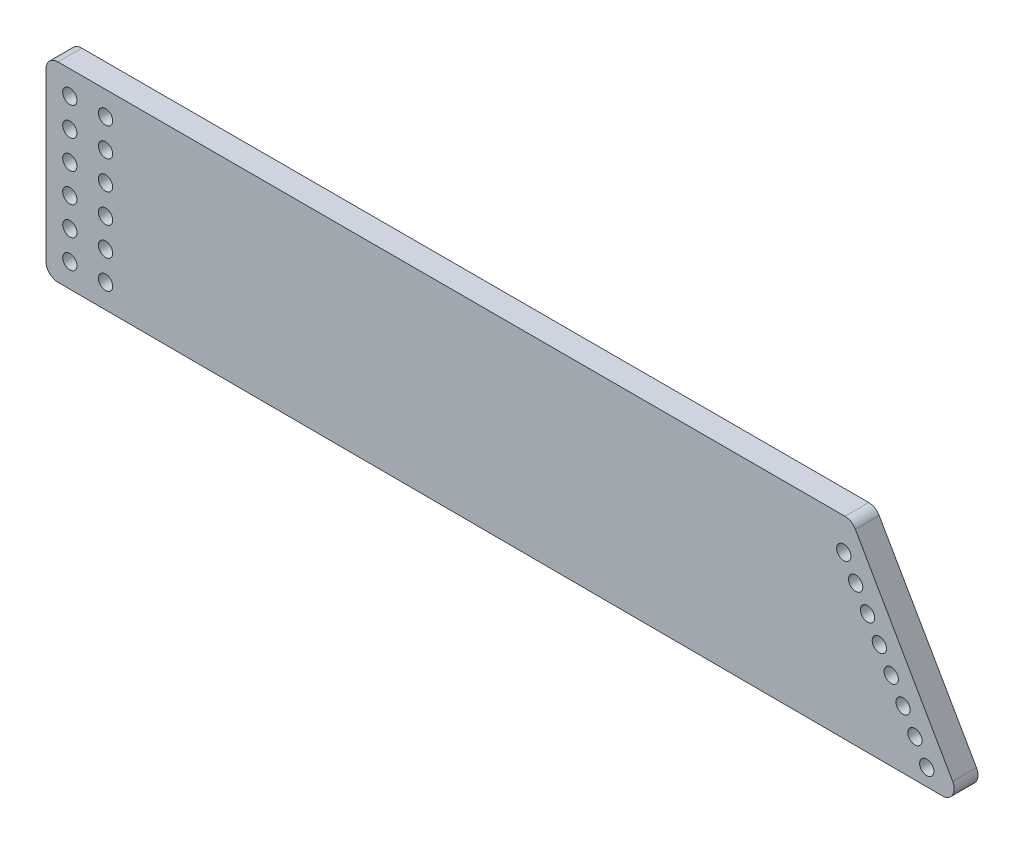
ISO-10303-21;
HEADER;
FILE_DESCRIPTION(('STEP AP214'),'2;1');
FILE_NAME('part.step','',(''),(''),'','','');
FILE_SCHEMA(('AUTOMOTIVE_DESIGN { 1 0 10303 214 1 1 1 1 }'));
ENDSEC;
DATA;
#1=APPLICATION_CONTEXT('core data for automotive mechanical design processes');
#2=APPLICATION_PROTOCOL_DEFINITION('international standard','automotive_design',2000,#1);
#3=PRODUCT_CONTEXT('',#1,'mechanical');
#4=PRODUCT('Part','Part','',(#3));
#5=PRODUCT_RELATED_PRODUCT_CATEGORY('part','',(#4));
#6=PRODUCT_DEFINITION_FORMATION('','',#4);
#7=PRODUCT_DEFINITION_CONTEXT('part definition',#1,'design');
#8=PRODUCT_DEFINITION('design','',#6,#7);
#9=PRODUCT_DEFINITION_SHAPE('','',#8);
#10=(LENGTH_UNIT() NAMED_UNIT(*) SI_UNIT(.MILLI.,.METRE.));
#11=(NAMED_UNIT(*) PLANE_ANGLE_UNIT() SI_UNIT($,.RADIAN.));
#12=(NAMED_UNIT(*) SI_UNIT($,.STERADIAN.) SOLID_ANGLE_UNIT());
#13=UNCERTAINTY_MEASURE_WITH_UNIT(LENGTH_MEASURE(1.E-05),#10,'distance_accuracy_value','');
#14=(GEOMETRIC_REPRESENTATION_CONTEXT(3) GLOBAL_UNCERTAINTY_ASSIGNED_CONTEXT((#13)) GLOBAL_UNIT_ASSIGNED_CONTEXT((#10,
#11,#12)) REPRESENTATION_CONTEXT('',''));
#15=CARTESIAN_POINT('',(0.,0.,0.));
#16=DIRECTION('',(0.,0.,1.));
#17=DIRECTION('',(1.,0.,0.));
#18=AXIS2_PLACEMENT_3D('',#15,#16,#17);
#19=CARTESIAN_POINT('',(-169.15,-40.0547591592116,10.));
#20=DIRECTION('',(1.,0.,0.));
#21=DIRECTION('',(0.,0.,-1.));
#22=AXIS2_PLACEMENT_3D('',#19,#20,#21);
#23=PLANE('',#22);
#24=DIRECTION('',(0.,-1.,0.));
#25=VECTOR('',#24,1.);
#26=CARTESIAN_POINT('',(-169.15,-40.0547591592116,0.));
#27=LINE('',#26,#25);
#28=CARTESIAN_POINT('',(-169.15,35.0547591592116,0.));
#29=VERTEX_POINT('',#28);
#30=CARTESIAN_POINT('',(-169.15,-35.0696361931255,0.));
#31=VERTEX_POINT('',#30);
#32=EDGE_CURVE('E129',#29,#31,#27,.T.);
#33=ORIENTED_EDGE('',*,*,#32,.T.);
#34=DIRECTION('',(0.,0.,-1.));
#35=VECTOR('',#34,1.);
#36=CARTESIAN_POINT('',(-169.15,-35.0696361931255,10.));
#37=LINE('',#36,#35);
#38=CARTESIAN_POINT('',(-169.15,-35.0696361931255,10.));
#39=VERTEX_POINT('',#38);
#40=EDGE_CURVE('E11',#31,#39,#37,.F.);
#41=ORIENTED_EDGE('',*,*,#40,.T.);
#42=DIRECTION('',(0.,-1.,0.));
#43=VECTOR('',#42,1.);
#44=CARTESIAN_POINT('',(-169.15,-40.0547591592116,10.));
#45=LINE('',#44,#43);
#46=CARTESIAN_POINT('',(-169.15,35.0547591592116,10.));
#47=VERTEX_POINT('',#46);
#48=EDGE_CURVE('E127',#47,#39,#45,.T.);
#49=ORIENTED_EDGE('',*,*,#48,.F.);
#50=DIRECTION('',(0.,0.,-1.));
#51=VECTOR('',#50,1.);
#52=CARTESIAN_POINT('',(-169.15,35.0547591592116,10.));
#53=LINE('',#52,#51);
#54=EDGE_CURVE('E41',#47,#29,#53,.T.);
#55=ORIENTED_EDGE('',*,*,#54,.T.);
#56=EDGE_LOOP('',(#33,#41,#49,#55));
#57=FACE_BOUND('',#56,.T.);
#58=ADVANCED_FACE('F33',(#57),#23,.F.);
#59=CARTESIAN_POINT('',(215.741136719662,-41.2016756718341,10.));
#60=DIRECTION('',(0.00297983328589271,0.999995560286939,0.));
#61=DIRECTION('',(-0.999995560286939,0.00297983328589271,0.));
#62=AXIS2_PLACEMENT_3D('',#59,#60,#61);
#63=PLANE('',#62);
#64=DIRECTION('',(0.999995560286938,-0.00297983328589271,0.));
#65=VECTOR('',#64,1.);
#66=CARTESIAN_POINT('',(215.741136719662,-41.2016756718341,0.));
#67=LINE('',#66,#65);
#68=CARTESIAN_POINT('',(-164.164899166429,-40.0696139945602,0.));
#69=VERTEX_POINT('',#68);
#70=CARTESIAN_POINT('',(207.080921130861,-41.1758695585879,0.));
#71=VERTEX_POINT('',#70);
#72=EDGE_CURVE('E125',#69,#71,#67,.T.);
#73=ORIENTED_EDGE('',*,*,#72,.T.);
#74=DIRECTION('',(0.,0.,-1.));
#75=VECTOR('',#74,1.);
#76=CARTESIAN_POINT('',(207.080921130861,-41.1758695585879,10.));
#77=LINE('',#76,#75);
#78=CARTESIAN_POINT('',(207.080921130861,-41.1758695585879,10.));
#79=VERTEX_POINT('',#78);
#80=EDGE_CURVE('E104',#71,#79,#77,.F.);
#81=ORIENTED_EDGE('',*,*,#80,.T.);
#82=DIRECTION('',(0.999995560286938,-0.00297983328589271,0.));
#83=VECTOR('',#82,1.);
#84=CARTESIAN_POINT('',(215.741136719662,-41.2016756718341,10.));
#85=LINE('',#84,#83);
#86=CARTESIAN_POINT('',(-164.164899166429,-40.0696139945602,10.));
#87=VERTEX_POINT('',#86);
#88=EDGE_CURVE('E169',#87,#79,#85,.T.);
#89=ORIENTED_EDGE('',*,*,#88,.F.);
#90=DIRECTION('',(0.,0.,-1.));
#91=VECTOR('',#90,1.);
#92=CARTESIAN_POINT('',(-164.164899166429,-40.0696139945602,10.));
#93=LINE('',#92,#91);
#94=EDGE_CURVE('E109',#87,#69,#93,.T.);
#95=ORIENTED_EDGE('',*,*,#94,.T.);
#96=EDGE_LOOP('',(#73,#81,#89,#95));
#97=FACE_BOUND('',#96,.T.);
#98=ADVANCED_FACE('F319',(#97),#63,.F.);
#99=CARTESIAN_POINT('',(169.15,40.0547591592116,10.));
#100=DIRECTION('',(-0.867511475523086,-0.497417168818848,0.));
#101=DIRECTION('',(0.497417168818848,-0.867511475523086,0.));
#102=AXIS2_PLACEMENT_3D('',#99,#100,#101);
#103=PLANE('',#102);
#104=DIRECTION('',(-0.497417168818848,0.867511475523086,0.));
#105=VECTOR('',#104,1.);
#106=CARTESIAN_POINT('',(169.15,40.0547591592116,10.));
#107=LINE('',#106,#105);
#108=CARTESIAN_POINT('',(211.433377674906,-33.6888059130589,10.));
#109=VERTEX_POINT('',#108);
#110=CARTESIAN_POINT('',(170.590864680391,37.5418450033058,10.));
#111=VERTEX_POINT('',#110);
#112=EDGE_CURVE('E118',#109,#111,#107,.T.);
#113=ORIENTED_EDGE('',*,*,#112,.F.);
#114=DIRECTION('',(0.,0.,-1.));
#115=VECTOR('',#114,1.);
#116=CARTESIAN_POINT('',(211.433377674906,-33.6888059130589,10.));
#117=LINE('',#116,#115);
#118=CARTESIAN_POINT('',(211.433377674906,-33.6888059130589,0.));
#119=VERTEX_POINT('',#118);
#120=EDGE_CURVE('E103',#109,#119,#117,.T.);
#121=ORIENTED_EDGE('',*,*,#120,.T.);
#122=DIRECTION('',(-0.497417168818848,0.867511475523086,0.));
#123=VECTOR('',#122,1.);
#124=CARTESIAN_POINT('',(169.15,40.0547591592116,0.));
#125=LINE('',#124,#123);
#126=CARTESIAN_POINT('',(170.590864680391,37.5418450033058,0.));
#127=VERTEX_POINT('',#126);
#128=EDGE_CURVE('E116',#119,#127,#125,.T.);
#129=ORIENTED_EDGE('',*,*,#128,.T.);
#130=DIRECTION('',(0.,0.,-1.));
#131=VECTOR('',#130,1.);
#132=CARTESIAN_POINT('',(170.590864680391,37.5418450033058,10.));
#133=LINE('',#132,#131);
#134=EDGE_CURVE('E120',#127,#111,#133,.F.);
#135=ORIENTED_EDGE('',*,*,#134,.T.);
#136=EDGE_LOOP('',(#113,#121,#129,#135));
#137=FACE_BOUND('',#136,.T.);
#138=ADVANCED_FACE('F115',(#137),#103,.F.);
#139=CARTESIAN_POINT('',(-169.15,40.0547591592116,10.));
#140=DIRECTION('',(0.,-1.,0.));
#141=DIRECTION('',(1.,0.,0.));
#142=AXIS2_PLACEMENT_3D('',#139,#140,#141);
#143=PLANE('',#142);
#144=DIRECTION('',(-1.,0.,0.));
#145=VECTOR('',#144,1.);
#146=CARTESIAN_POINT('',(-169.15,40.0547591592116,10.));
#147=LINE('',#146,#145);
#148=CARTESIAN_POINT('',(166.253307302776,40.0547591592116,10.));
#149=VERTEX_POINT('',#148);
#150=CARTESIAN_POINT('',(-164.15,40.0547591592116,10.));
#151=VERTEX_POINT('',#150);
#152=EDGE_CURVE('E133',#149,#151,#147,.T.);
#153=ORIENTED_EDGE('',*,*,#152,.F.);
#154=DIRECTION('',(0.,0.,-1.));
#155=VECTOR('',#154,1.);
#156=CARTESIAN_POINT('',(166.253307302776,40.0547591592116,10.));
#157=LINE('',#156,#155);
#158=CARTESIAN_POINT('',(166.253307302776,40.0547591592116,0.));
#159=VERTEX_POINT('',#158);
#160=EDGE_CURVE('E150',#149,#159,#157,.T.);
#161=ORIENTED_EDGE('',*,*,#160,.T.);
#162=DIRECTION('',(-1.,0.,0.));
#163=VECTOR('',#162,1.);
#164=CARTESIAN_POINT('',(-169.15,40.0547591592116,0.));
#165=LINE('',#164,#163);
#166=CARTESIAN_POINT('',(-164.15,40.0547591592116,0.));
#167=VERTEX_POINT('',#166);
#168=EDGE_CURVE('E124',#159,#167,#165,.T.);
#169=ORIENTED_EDGE('',*,*,#168,.T.);
#170=DIRECTION('',(0.,0.,-1.));
#171=VECTOR('',#170,1.);
#172=CARTESIAN_POINT('',(-164.15,40.0547591592116,10.));
#173=LINE('',#172,#171);
#174=EDGE_CURVE('E48',#167,#151,#173,.F.);
#175=ORIENTED_EDGE('',*,*,#174,.T.);
#176=EDGE_LOOP('',(#153,#161,#169,#175));
#177=FACE_BOUND('',#176,.T.);
#178=ADVANCED_FACE('F312',(#177),#143,.F.);
#179=CARTESIAN_POINT('',(0.,0.,10.));
#180=DIRECTION('',(0.,0.,-1.));
#181=DIRECTION('',(-1.,0.,0.));
#182=AXIS2_PLACEMENT_3D('',#179,#180,#181);
#183=PLANE('',#182);
#184=CARTESIAN_POINT('',(180.685584579235,0.645927325171431,10.));
#185=DIRECTION('',(0.,0.,-1.));
#186=DIRECTION('',(-1.,0.,0.));
#187=AXIS2_PLACEMENT_3D('',#184,#185,#186);
#188=CIRCLE('',#187,2.99999999999999);
#189=CARTESIAN_POINT('',(177.685584579235,0.645927325171431,10.));
#190=VERTEX_POINT('',#189);
#191=EDGE_CURVE('E162',#190,#190,#188,.T.);
#192=ORIENTED_EDGE('',*,*,#191,.T.);
#193=EDGE_LOOP('',(#192));
#194=FACE_BOUND('',#193,.T.);
#195=CARTESIAN_POINT('',(185.659756267424,-8.02918743005944,10.));
#196=DIRECTION('',(0.,0.,-1.));
#197=DIRECTION('',(-1.,0.,0.));
#198=AXIS2_PLACEMENT_3D('',#195,#196,#197);
#199=CIRCLE('',#198,2.99999999999999);
#200=CARTESIAN_POINT('',(182.659756267424,-8.02918743005944,10.));
#201=VERTEX_POINT('',#200);
#202=EDGE_CURVE('E164',#201,#201,#199,.T.);
#203=ORIENTED_EDGE('',*,*,#202,.T.);
#204=EDGE_LOOP('',(#203));
#205=FACE_BOUND('',#204,.T.);
#206=CARTESIAN_POINT('',(190.633927955612,-16.7043021852903,10.));
#207=DIRECTION('',(0.,0.,-1.));
#208=DIRECTION('',(-1.,0.,0.));
#209=AXIS2_PLACEMENT_3D('',#206,#207,#208);
#210=CIRCLE('',#209,2.99999999999999);
#211=CARTESIAN_POINT('',(187.633927955612,-16.7043021852903,10.));
#212=VERTEX_POINT('',#211);
#213=EDGE_CURVE('E175',#212,#212,#210,.T.);
#214=ORIENTED_EDGE('',*,*,#213,.T.);
#215=EDGE_LOOP('',(#214));
#216=FACE_BOUND('',#215,.T.);
#217=CARTESIAN_POINT('',(195.608099643801,-25.3794169405212,10.));
#218=DIRECTION('',(0.,0.,-1.));
#219=DIRECTION('',(-1.,0.,0.));
#220=AXIS2_PLACEMENT_3D('',#217,#218,#219);
#221=CIRCLE('',#220,2.99999999999999);
#222=CARTESIAN_POINT('',(192.608099643801,-25.3794169405212,10.));
#223=VERTEX_POINT('',#222);
#224=EDGE_CURVE('E178',#223,#223,#221,.T.);
#225=ORIENTED_EDGE('',*,*,#224,.T.);
#226=EDGE_LOOP('',(#225));
#227=FACE_BOUND('',#226,.T.);
#228=CARTESIAN_POINT('',(165.76306951467,26.671271590864,10.));
#229=DIRECTION('',(0.,0.,-1.));
#230=DIRECTION('',(-1.,0.,0.));
#231=AXIS2_PLACEMENT_3D('',#228,#229,#230);
#232=CIRCLE('',#231,2.99999999999999);
#233=CARTESIAN_POINT('',(162.76306951467,26.671271590864,10.));
#234=VERTEX_POINT('',#233);
#235=EDGE_CURVE('E181',#234,#234,#232,.T.);
#236=ORIENTED_EDGE('',*,*,#235,.T.);
#237=EDGE_LOOP('',(#236));
#238=FACE_BOUND('',#237,.T.);
#239=CARTESIAN_POINT('',(-144.147356074622,-30.0674372837863,10.));
#240=DIRECTION('',(0.,0.,-1.));
#241=DIRECTION('',(-1.,0.,0.));
#242=AXIS2_PLACEMENT_3D('',#239,#240,#241);
#243=CIRCLE('',#242,2.99999999999994);
#244=CARTESIAN_POINT('',(-147.147356074622,-30.0674372837863,10.));
#245=VERTEX_POINT('',#244);
#246=EDGE_CURVE('E184',#245,#245,#243,.T.);
#247=ORIENTED_EDGE('',*,*,#246,.T.);
#248=EDGE_LOOP('',(#247));
#249=FACE_BOUND('',#248,.T.);
#250=CARTESIAN_POINT('',(-159.147356016605,-30.0687565596259,10.));
#251=DIRECTION('',(0.,0.,-1.));
#252=DIRECTION('',(-1.,0.,0.));
#253=AXIS2_PLACEMENT_3D('',#250,#251,#252);
#254=CIRCLE('',#253,2.99999999999999);
#255=CARTESIAN_POINT('',(-162.147356016605,-30.0687565596259,10.));
#256=VERTEX_POINT('',#255);
#257=EDGE_CURVE('E187',#256,#256,#254,.T.);
#258=ORIENTED_EDGE('',*,*,#257,.T.);
#259=EDGE_LOOP('',(#258));
#260=FACE_BOUND('',#259,.T.);
#261=CARTESIAN_POINT('',(-159.148411437277,-18.068756606039,10.));
#262=DIRECTION('',(0.,0.,-1.));
#263=DIRECTION('',(-1.,0.,0.));
#264=AXIS2_PLACEMENT_3D('',#261,#262,#263);
#265=CIRCLE('',#264,2.99999999999999);
#266=CARTESIAN_POINT('',(-162.148411437277,-18.068756606039,10.));
#267=VERTEX_POINT('',#266);
#268=EDGE_CURVE('E190',#267,#267,#265,.T.);
#269=ORIENTED_EDGE('',*,*,#268,.T.);
#270=EDGE_LOOP('',(#269));
#271=FACE_BOUND('',#270,.T.);
#272=CARTESIAN_POINT('',(-144.15,18.0547591592116,10.));
#273=DIRECTION('',(0.,0.,-1.));
#274=DIRECTION('',(-1.,0.,0.));
#275=AXIS2_PLACEMENT_3D('',#272,#273,#274);
#276=CIRCLE('',#275,2.99999999999999);
#277=CARTESIAN_POINT('',(-147.15,18.0547591592116,10.));
#278=VERTEX_POINT('',#277);
#279=EDGE_CURVE('E193',#278,#278,#276,.T.);
#280=ORIENTED_EDGE('',*,*,#279,.T.);
#281=EDGE_LOOP('',(#280));
#282=FACE_BOUND('',#281,.T.);
#283=CARTESIAN_POINT('',(-159.15,6.05475915921157,10.));
#284=DIRECTION('',(0.,0.,-1.));
#285=DIRECTION('',(-1.,0.,0.));
#286=AXIS2_PLACEMENT_3D('',#283,#284,#285);
#287=CIRCLE('',#286,2.99999999999999);
#288=CARTESIAN_POINT('',(-162.15,6.05475915921157,10.));
#289=VERTEX_POINT('',#288);
#290=EDGE_CURVE('E196',#289,#289,#287,.T.);
#291=ORIENTED_EDGE('',*,*,#290,.T.);
#292=EDGE_LOOP('',(#291));
#293=FACE_BOUND('',#292,.T.);
#294=CARTESIAN_POINT('',(-159.15,18.0547591592116,10.));
#295=DIRECTION('',(0.,0.,-1.));
#296=DIRECTION('',(-1.,0.,0.));
#297=AXIS2_PLACEMENT_3D('',#294,#295,#296);
#298=CIRCLE('',#297,2.99999999999999);
#299=CARTESIAN_POINT('',(-162.15,18.0547591592116,10.));
#300=VERTEX_POINT('',#299);
#301=EDGE_CURVE('E199',#300,#300,#298,.T.);
#302=ORIENTED_EDGE('',*,*,#301,.T.);
#303=EDGE_LOOP('',(#302));
#304=FACE_BOUND('',#303,.T.);
#305=CARTESIAN_POINT('',(-159.15,30.0547591592116,10.));
#306=DIRECTION('',(0.,0.,-1.));
#307=DIRECTION('',(-1.,0.,0.));
#308=AXIS2_PLACEMENT_3D('',#305,#306,#307);
#309=CIRCLE('',#308,2.99999999999999);
#310=CARTESIAN_POINT('',(-162.15,30.0547591592116,10.));
#311=VERTEX_POINT('',#310);
#312=EDGE_CURVE('E202',#311,#311,#309,.T.);
#313=ORIENTED_EDGE('',*,*,#312,.T.);
#314=EDGE_LOOP('',(#313));
#315=FACE_BOUND('',#314,.T.);
#316=CARTESIAN_POINT('',(-159.149466857949,-6.06875665245198,10.));
#317=DIRECTION('',(0.,0.,-1.));
#318=DIRECTION('',(-1.,0.,0.));
#319=AXIS2_PLACEMENT_3D('',#316,#317,#318);
#320=CIRCLE('',#319,2.99999999999999);
#321=CARTESIAN_POINT('',(-162.149466857949,-6.06875665245198,10.));
#322=VERTEX_POINT('',#321);
#323=EDGE_CURVE('E205',#322,#322,#320,.T.);
#324=ORIENTED_EDGE('',*,*,#323,.T.);
#325=EDGE_LOOP('',(#324));
#326=FACE_BOUND('',#325,.T.);
#327=CARTESIAN_POINT('',(-144.148411495293,-18.0674373301993,10.));
#328=DIRECTION('',(0.,0.,-1.));
#329=DIRECTION('',(-1.,0.,0.));
#330=AXIS2_PLACEMENT_3D('',#327,#328,#329);
#331=CIRCLE('',#330,2.99999999999994);
#332=CARTESIAN_POINT('',(-147.148411495293,-18.0674373301993,10.));
#333=VERTEX_POINT('',#332);
#334=EDGE_CURVE('E208',#333,#333,#331,.T.);
#335=ORIENTED_EDGE('',*,*,#334,.T.);
#336=EDGE_LOOP('',(#335));
#337=FACE_BOUND('',#336,.T.);
#338=CARTESIAN_POINT('',(-144.149466915965,-6.06743737661232,10.));
#339=DIRECTION('',(0.,0.,-1.));
#340=DIRECTION('',(-1.,0.,0.));
#341=AXIS2_PLACEMENT_3D('',#338,#339,#340);
#342=CIRCLE('',#341,2.99999999999994);
#343=CARTESIAN_POINT('',(-147.149466915965,-6.06743737661232,10.));
#344=VERTEX_POINT('',#343);
#345=EDGE_CURVE('E211',#344,#344,#342,.T.);
#346=ORIENTED_EDGE('',*,*,#345,.T.);
#347=EDGE_LOOP('',(#346));
#348=FACE_BOUND('',#347,.T.);
#349=CARTESIAN_POINT('',(-144.15,6.05475915921157,10.));
#350=DIRECTION('',(0.,0.,-1.));
#351=DIRECTION('',(-1.,0.,0.));
#352=AXIS2_PLACEMENT_3D('',#349,#350,#351);
#353=CIRCLE('',#352,2.99999999999999);
#354=CARTESIAN_POINT('',(-147.15,6.05475915921157,10.));
#355=VERTEX_POINT('',#354);
#356=EDGE_CURVE('E214',#355,#355,#353,.T.);
#357=ORIENTED_EDGE('',*,*,#356,.T.);
#358=EDGE_LOOP('',(#357));
#359=FACE_BOUND('',#358,.T.);
#360=CARTESIAN_POINT('',(175.711412891047,9.32104208040228,10.));
#361=DIRECTION('',(0.,0.,-1.));
#362=DIRECTION('',(-1.,0.,0.));
#363=AXIS2_PLACEMENT_3D('',#360,#361,#362);
#364=CIRCLE('',#363,2.99999999999999);
#365=CARTESIAN_POINT('',(172.711412891047,9.32104208040228,10.));
#366=VERTEX_POINT('',#365);
#367=EDGE_CURVE('E217',#366,#366,#364,.T.);
#368=ORIENTED_EDGE('',*,*,#367,.T.);
#369=EDGE_LOOP('',(#368));
#370=FACE_BOUND('',#369,.T.);
#371=CARTESIAN_POINT('',(170.737241202858,17.9961568356331,10.));
#372=DIRECTION('',(0.,0.,-1.));
#373=DIRECTION('',(-1.,0.,0.));
#374=AXIS2_PLACEMENT_3D('',#371,#372,#373);
#375=CIRCLE('',#374,2.99999999999999);
#376=CARTESIAN_POINT('',(167.737241202858,17.9961568356331,10.));
#377=VERTEX_POINT('',#376);
#378=EDGE_CURVE('E220',#377,#377,#375,.T.);
#379=ORIENTED_EDGE('',*,*,#378,.T.);
#380=EDGE_LOOP('',(#379));
#381=FACE_BOUND('',#380,.T.);
#382=CARTESIAN_POINT('',(200.582271331989,-34.054531695752,10.));
#383=DIRECTION('',(0.,0.,-1.));
#384=DIRECTION('',(-1.,0.,0.));
#385=AXIS2_PLACEMENT_3D('',#382,#383,#384);
#386=CIRCLE('',#385,2.99999999999999);
#387=CARTESIAN_POINT('',(197.582271331989,-34.054531695752,10.));
#388=VERTEX_POINT('',#387);
#389=EDGE_CURVE('E223',#388,#388,#386,.T.);
#390=ORIENTED_EDGE('',*,*,#389,.T.);
#391=EDGE_LOOP('',(#390));
#392=FACE_BOUND('',#391,.T.);
#393=CARTESIAN_POINT('',(-144.15,30.0547591592116,10.));
#394=DIRECTION('',(0.,0.,-1.));
#395=DIRECTION('',(-1.,0.,0.));
#396=AXIS2_PLACEMENT_3D('',#393,#394,#395);
#397=CIRCLE('',#396,2.99999999999999);
#398=CARTESIAN_POINT('',(-147.15,30.0547591592116,10.));
#399=VERTEX_POINT('',#398);
#400=EDGE_CURVE('E226',#399,#399,#397,.T.);
#401=ORIENTED_EDGE('',*,*,#400,.T.);
#402=EDGE_LOOP('',(#401));
#403=FACE_BOUND('',#402,.T.);
#404=ORIENTED_EDGE('',*,*,#88,.T.);
#405=CARTESIAN_POINT('',(207.09582029729,-36.1758917571532,10.));
#406=DIRECTION('',(0.,0.,-1.));
#407=DIRECTION('',(-1.,0.,0.));
#408=AXIS2_PLACEMENT_3D('',#405,#406,#407);
#409=CIRCLE('',#408,5.);
#410=EDGE_CURVE('E147',#79,#109,#409,.F.);
#411=ORIENTED_EDGE('',*,*,#410,.T.);
#412=ORIENTED_EDGE('',*,*,#112,.T.);
#413=CARTESIAN_POINT('',(166.253307302776,35.0547591592116,10.));
#414=DIRECTION('',(0.,0.,-1.));
#415=DIRECTION('',(-1.,0.,0.));
#416=AXIS2_PLACEMENT_3D('',#413,#414,#415);
#417=CIRCLE('',#416,5.);
#418=EDGE_CURVE('E55',#111,#149,#417,.F.);
#419=ORIENTED_EDGE('',*,*,#418,.T.);
#420=ORIENTED_EDGE('',*,*,#152,.T.);
#421=CARTESIAN_POINT('',(-164.15,35.0547591592116,10.));
#422=DIRECTION('',(0.,0.,-1.));
#423=DIRECTION('',(-1.,0.,0.));
#424=AXIS2_PLACEMENT_3D('',#421,#422,#423);
#425=CIRCLE('',#424,5.);
#426=EDGE_CURVE('E142',#151,#47,#425,.F.);
#427=ORIENTED_EDGE('',*,*,#426,.T.);
#428=ORIENTED_EDGE('',*,*,#48,.T.);
#429=CARTESIAN_POINT('',(-164.15,-35.0696361931255,10.));
#430=DIRECTION('',(0.,0.,-1.));
#431=DIRECTION('',(-1.,0.,0.));
#432=AXIS2_PLACEMENT_3D('',#429,#430,#431);
#433=CIRCLE('',#432,5.);
#434=EDGE_CURVE('E144',#39,#87,#433,.F.);
#435=ORIENTED_EDGE('',*,*,#434,.T.);
#436=EDGE_LOOP('',(#404,#411,#412,#419,#420,#427,#428,#435));
#437=FACE_BOUND('',#436,.T.);
#438=ADVANCED_FACE('F295',(#194,#205,#216,#227,#238,#249,#260,#271,#282,#293,#304,#315,#326,
#337,#348,#359,#370,#381,#392,#403,#437),#183,.F.);
#439=CARTESIAN_POINT('',(0.,0.,0.));
#440=DIRECTION('',(0.,0.,-1.));
#441=DIRECTION('',(-1.,0.,0.));
#442=AXIS2_PLACEMENT_3D('',#439,#440,#441);
#443=PLANE('',#442);
#444=CARTESIAN_POINT('',(180.685584579235,0.645927325171431,0.));
#445=DIRECTION('',(0.,0.,-1.));
#446=DIRECTION('',(-1.,0.,0.));
#447=AXIS2_PLACEMENT_3D('',#444,#445,#446);
#448=CIRCLE('',#447,2.99999999999999);
#449=CARTESIAN_POINT('',(177.685584579235,0.645927325171431,0.));
#450=VERTEX_POINT('',#449);
#451=EDGE_CURVE('E257',#450,#450,#448,.T.);
#452=ORIENTED_EDGE('',*,*,#451,.F.);
#453=EDGE_LOOP('',(#452));
#454=FACE_BOUND('',#453,.T.);
#455=CARTESIAN_POINT('',(185.659756267424,-8.02918743005944,0.));
#456=DIRECTION('',(0.,0.,-1.));
#457=DIRECTION('',(-1.,0.,0.));
#458=AXIS2_PLACEMENT_3D('',#455,#456,#457);
#459=CIRCLE('',#458,2.99999999999999);
#460=CARTESIAN_POINT('',(182.659756267424,-8.02918743005944,0.));
#461=VERTEX_POINT('',#460);
#462=EDGE_CURVE('E260',#461,#461,#459,.T.);
#463=ORIENTED_EDGE('',*,*,#462,.F.);
#464=EDGE_LOOP('',(#463));
#465=FACE_BOUND('',#464,.T.);
#466=CARTESIAN_POINT('',(190.633927955612,-16.7043021852903,0.));
#467=DIRECTION('',(0.,0.,-1.));
#468=DIRECTION('',(-1.,0.,0.));
#469=AXIS2_PLACEMENT_3D('',#466,#467,#468);
#470=CIRCLE('',#469,2.99999999999999);
#471=CARTESIAN_POINT('',(187.633927955612,-16.7043021852903,0.));
#472=VERTEX_POINT('',#471);
#473=EDGE_CURVE('E264',#472,#472,#470,.T.);
#474=ORIENTED_EDGE('',*,*,#473,.F.);
#475=EDGE_LOOP('',(#474));
#476=FACE_BOUND('',#475,.T.);
#477=CARTESIAN_POINT('',(195.608099643801,-25.3794169405212,0.));
#478=DIRECTION('',(0.,0.,-1.));
#479=DIRECTION('',(-1.,0.,0.));
#480=AXIS2_PLACEMENT_3D('',#477,#478,#479);
#481=CIRCLE('',#480,2.99999999999999);
#482=CARTESIAN_POINT('',(192.608099643801,-25.3794169405212,0.));
#483=VERTEX_POINT('',#482);
#484=EDGE_CURVE('E267',#483,#483,#481,.T.);
#485=ORIENTED_EDGE('',*,*,#484,.F.);
#486=EDGE_LOOP('',(#485));
#487=FACE_BOUND('',#486,.T.);
#488=CARTESIAN_POINT('',(165.76306951467,26.671271590864,0.));
#489=DIRECTION('',(0.,0.,-1.));
#490=DIRECTION('',(-1.,0.,0.));
#491=AXIS2_PLACEMENT_3D('',#488,#489,#490);
#492=CIRCLE('',#491,2.99999999999999);
#493=CARTESIAN_POINT('',(162.76306951467,26.671271590864,0.));
#494=VERTEX_POINT('',#493);
#495=EDGE_CURVE('E270',#494,#494,#492,.T.);
#496=ORIENTED_EDGE('',*,*,#495,.F.);
#497=EDGE_LOOP('',(#496));
#498=FACE_BOUND('',#497,.T.);
#499=CARTESIAN_POINT('',(-144.147356074622,-30.0674372837863,0.));
#500=DIRECTION('',(0.,0.,-1.));
#501=DIRECTION('',(1.,0.,0.));
#502=AXIS2_PLACEMENT_3D('',#499,#500,#501);
#503=CIRCLE('',#502,2.99999999999994);
#504=CARTESIAN_POINT('',(-141.147356074622,-30.0674372837863,0.));
#505=VERTEX_POINT('',#504);
#506=EDGE_CURVE('E273',#505,#505,#503,.T.);
#507=ORIENTED_EDGE('',*,*,#506,.F.);
#508=EDGE_LOOP('',(#507));
#509=FACE_BOUND('',#508,.T.);
#510=CARTESIAN_POINT('',(-159.147356016605,-30.0687565596259,0.));
#511=DIRECTION('',(0.,0.,-1.));
#512=DIRECTION('',(1.,0.,0.));
#513=AXIS2_PLACEMENT_3D('',#510,#511,#512);
#514=CIRCLE('',#513,2.99999999999999);
#515=CARTESIAN_POINT('',(-156.147356016605,-30.0687565596259,0.));
#516=VERTEX_POINT('',#515);
#517=EDGE_CURVE('E276',#516,#516,#514,.T.);
#518=ORIENTED_EDGE('',*,*,#517,.F.);
#519=EDGE_LOOP('',(#518));
#520=FACE_BOUND('',#519,.T.);
#521=CARTESIAN_POINT('',(-159.148411437277,-18.068756606039,0.));
#522=DIRECTION('',(0.,0.,-1.));
#523=DIRECTION('',(1.,0.,0.));
#524=AXIS2_PLACEMENT_3D('',#521,#522,#523);
#525=CIRCLE('',#524,2.99999999999999);
#526=CARTESIAN_POINT('',(-156.148411437277,-18.068756606039,0.));
#527=VERTEX_POINT('',#526);
#528=EDGE_CURVE('E254',#527,#527,#525,.T.);
#529=ORIENTED_EDGE('',*,*,#528,.F.);
#530=EDGE_LOOP('',(#529));
#531=FACE_BOUND('',#530,.T.);
#532=CARTESIAN_POINT('',(-144.15,18.0547591592116,0.));
#533=DIRECTION('',(0.,0.,-1.));
#534=DIRECTION('',(-1.,0.,0.));
#535=AXIS2_PLACEMENT_3D('',#532,#533,#534);
#536=CIRCLE('',#535,2.99999999999999);
#537=CARTESIAN_POINT('',(-147.15,18.0547591592116,0.));
#538=VERTEX_POINT('',#537);
#539=EDGE_CURVE('E239',#538,#538,#536,.T.);
#540=ORIENTED_EDGE('',*,*,#539,.F.);
#541=EDGE_LOOP('',(#540));
#542=FACE_BOUND('',#541,.T.);
#543=CARTESIAN_POINT('',(-159.15,6.05475915921157,0.));
#544=DIRECTION('',(0.,0.,-1.));
#545=DIRECTION('',(-1.,0.,0.));
#546=AXIS2_PLACEMENT_3D('',#543,#544,#545);
#547=CIRCLE('',#546,2.99999999999999);
#548=CARTESIAN_POINT('',(-162.15,6.05475915921157,0.));
#549=VERTEX_POINT('',#548);
#550=EDGE_CURVE('E236',#549,#549,#547,.T.);
#551=ORIENTED_EDGE('',*,*,#550,.F.);
#552=EDGE_LOOP('',(#551));
#553=FACE_BOUND('',#552,.T.);
#554=CARTESIAN_POINT('',(-159.15,18.0547591592116,0.));
#555=DIRECTION('',(0.,0.,-1.));
#556=DIRECTION('',(-1.,0.,0.));
#557=AXIS2_PLACEMENT_3D('',#554,#555,#556);
#558=CIRCLE('',#557,2.99999999999999);
#559=CARTESIAN_POINT('',(-162.15,18.0547591592116,0.));
#560=VERTEX_POINT('',#559);
#561=EDGE_CURVE('E233',#560,#560,#558,.T.);
#562=ORIENTED_EDGE('',*,*,#561,.F.);
#563=EDGE_LOOP('',(#562));
#564=FACE_BOUND('',#563,.T.);
#565=CARTESIAN_POINT('',(-159.15,30.0547591592116,0.));
#566=DIRECTION('',(0.,0.,-1.));
#567=DIRECTION('',(-1.,0.,0.));
#568=AXIS2_PLACEMENT_3D('',#565,#566,#567);
#569=CIRCLE('',#568,2.99999999999999);
#570=CARTESIAN_POINT('',(-162.15,30.0547591592116,0.));
#571=VERTEX_POINT('',#570);
#572=EDGE_CURVE('E232',#571,#571,#569,.T.);
#573=ORIENTED_EDGE('',*,*,#572,.F.);
#574=EDGE_LOOP('',(#573));
#575=FACE_BOUND('',#574,.T.);
#576=CARTESIAN_POINT('',(-159.149466857949,-6.06875665245198,0.));
#577=DIRECTION('',(0.,0.,-1.));
#578=DIRECTION('',(1.,0.,0.));
#579=AXIS2_PLACEMENT_3D('',#576,#577,#578);
#580=CIRCLE('',#579,2.99999999999999);
#581=CARTESIAN_POINT('',(-156.149466857949,-6.06875665245198,0.));
#582=VERTEX_POINT('',#581);
#583=EDGE_CURVE('E251',#582,#582,#580,.T.);
#584=ORIENTED_EDGE('',*,*,#583,.F.);
#585=EDGE_LOOP('',(#584));
#586=FACE_BOUND('',#585,.T.);
#587=CARTESIAN_POINT('',(-144.148411495293,-18.0674373301993,0.));
#588=DIRECTION('',(0.,0.,-1.));
#589=DIRECTION('',(1.,0.,0.));
#590=AXIS2_PLACEMENT_3D('',#587,#588,#589);
#591=CIRCLE('',#590,2.99999999999994);
#592=CARTESIAN_POINT('',(-141.148411495294,-18.0674373301993,0.));
#593=VERTEX_POINT('',#592);
#594=EDGE_CURVE('E248',#593,#593,#591,.T.);
#595=ORIENTED_EDGE('',*,*,#594,.F.);
#596=EDGE_LOOP('',(#595));
#597=FACE_BOUND('',#596,.T.);
#598=CARTESIAN_POINT('',(-144.149466915965,-6.06743737661232,0.));
#599=DIRECTION('',(0.,0.,-1.));
#600=DIRECTION('',(1.,0.,0.));
#601=AXIS2_PLACEMENT_3D('',#598,#599,#600);
#602=CIRCLE('',#601,2.99999999999994);
#603=CARTESIAN_POINT('',(-141.149466915965,-6.06743737661232,0.));
#604=VERTEX_POINT('',#603);
#605=EDGE_CURVE('E245',#604,#604,#602,.T.);
#606=ORIENTED_EDGE('',*,*,#605,.F.);
#607=EDGE_LOOP('',(#606));
#608=FACE_BOUND('',#607,.T.);
#609=CARTESIAN_POINT('',(-144.15,6.05475915921157,0.));
#610=DIRECTION('',(0.,0.,-1.));
#611=DIRECTION('',(-1.,0.,0.));
#612=AXIS2_PLACEMENT_3D('',#609,#610,#611);
#613=CIRCLE('',#612,2.99999999999999);
#614=CARTESIAN_POINT('',(-147.15,6.05475915921157,0.));
#615=VERTEX_POINT('',#614);
#616=EDGE_CURVE('E242',#615,#615,#613,.T.);
#617=ORIENTED_EDGE('',*,*,#616,.F.);
#618=EDGE_LOOP('',(#617));
#619=FACE_BOUND('',#618,.T.);
#620=CARTESIAN_POINT('',(175.711412891047,9.32104208040228,0.));
#621=DIRECTION('',(0.,0.,-1.));
#622=DIRECTION('',(-1.,0.,0.));
#623=AXIS2_PLACEMENT_3D('',#620,#621,#622);
#624=CIRCLE('',#623,2.99999999999999);
#625=CARTESIAN_POINT('',(172.711412891047,9.32104208040228,0.));
#626=VERTEX_POINT('',#625);
#627=EDGE_CURVE('E261',#626,#626,#624,.T.);
#628=ORIENTED_EDGE('',*,*,#627,.F.);
#629=EDGE_LOOP('',(#628));
#630=FACE_BOUND('',#629,.T.);
#631=CARTESIAN_POINT('',(170.737241202858,17.9961568356331,0.));
#632=DIRECTION('',(0.,0.,-1.));
#633=DIRECTION('',(-1.,0.,0.));
#634=AXIS2_PLACEMENT_3D('',#631,#632,#633);
#635=CIRCLE('',#634,2.99999999999999);
#636=CARTESIAN_POINT('',(167.737241202858,17.9961568356331,0.));
#637=VERTEX_POINT('',#636);
#638=EDGE_CURVE('E284',#637,#637,#635,.T.);
#639=ORIENTED_EDGE('',*,*,#638,.F.);
#640=EDGE_LOOP('',(#639));
#641=FACE_BOUND('',#640,.T.);
#642=CARTESIAN_POINT('',(200.582271331989,-34.054531695752,0.));
#643=DIRECTION('',(0.,0.,-1.));
#644=DIRECTION('',(-1.,0.,0.));
#645=AXIS2_PLACEMENT_3D('',#642,#643,#644);
#646=CIRCLE('',#645,2.99999999999999);
#647=CARTESIAN_POINT('',(197.582271331989,-34.054531695752,0.));
#648=VERTEX_POINT('',#647);
#649=EDGE_CURVE('E281',#648,#648,#646,.T.);
#650=ORIENTED_EDGE('',*,*,#649,.F.);
#651=EDGE_LOOP('',(#650));
#652=FACE_BOUND('',#651,.T.);
#653=CARTESIAN_POINT('',(-144.15,30.0547591592116,0.));
#654=DIRECTION('',(0.,0.,-1.));
#655=DIRECTION('',(-1.,0.,0.));
#656=AXIS2_PLACEMENT_3D('',#653,#654,#655);
#657=CIRCLE('',#656,2.99999999999999);
#658=CARTESIAN_POINT('',(-147.15,30.0547591592116,0.));
#659=VERTEX_POINT('',#658);
#660=EDGE_CURVE('E229',#659,#659,#657,.T.);
#661=ORIENTED_EDGE('',*,*,#660,.F.);
#662=EDGE_LOOP('',(#661));
#663=FACE_BOUND('',#662,.T.);
#664=ORIENTED_EDGE('',*,*,#128,.F.);
#665=CARTESIAN_POINT('',(207.09582029729,-36.1758917571532,0.));
#666=DIRECTION('',(0.,0.,-1.));
#667=DIRECTION('',(-1.,0.,0.));
#668=AXIS2_PLACEMENT_3D('',#665,#666,#667);
#669=CIRCLE('',#668,5.);
#670=EDGE_CURVE('E99',#119,#71,#669,.T.);
#671=ORIENTED_EDGE('',*,*,#670,.T.);
#672=ORIENTED_EDGE('',*,*,#72,.F.);
#673=CARTESIAN_POINT('',(-164.15,-35.0696361931255,0.));
#674=DIRECTION('',(0.,0.,-1.));
#675=DIRECTION('',(-1.,0.,0.));
#676=AXIS2_PLACEMENT_3D('',#673,#674,#675);
#677=CIRCLE('',#676,5.);
#678=EDGE_CURVE('E136',#69,#31,#677,.T.);
#679=ORIENTED_EDGE('',*,*,#678,.T.);
#680=ORIENTED_EDGE('',*,*,#32,.F.);
#681=CARTESIAN_POINT('',(-164.15,35.0547591592116,0.));
#682=DIRECTION('',(0.,0.,-1.));
#683=DIRECTION('',(-1.,0.,0.));
#684=AXIS2_PLACEMENT_3D('',#681,#682,#683);
#685=CIRCLE('',#684,5.);
#686=EDGE_CURVE('E119',#29,#167,#685,.T.);
#687=ORIENTED_EDGE('',*,*,#686,.T.);
#688=ORIENTED_EDGE('',*,*,#168,.F.);
#689=CARTESIAN_POINT('',(166.253307302776,35.0547591592116,0.));
#690=DIRECTION('',(0.,0.,-1.));
#691=DIRECTION('',(-1.,0.,0.));
#692=AXIS2_PLACEMENT_3D('',#689,#690,#691);
#693=CIRCLE('',#692,5.);
#694=EDGE_CURVE('E110',#159,#127,#693,.T.);
#695=ORIENTED_EDGE('',*,*,#694,.T.);
#696=EDGE_LOOP('',(#664,#671,#672,#679,#680,#687,#688,#695));
#697=FACE_BOUND('',#696,.T.);
#698=ADVANCED_FACE('F122',(#454,#465,#476,#487,#498,#509,#520,#531,#542,#553,#564,#575,#586,
#597,#608,#619,#630,#641,#652,#663,#697),#443,.T.);
#699=CARTESIAN_POINT('',(207.09582029729,-36.1758917571532,10.));
#700=DIRECTION('',(0.,0.,-1.));
#701=DIRECTION('',(-1.,0.,0.));
#702=AXIS2_PLACEMENT_3D('',#699,#700,#701);
#703=CYLINDRICAL_SURFACE('',#702,5.);
#704=ORIENTED_EDGE('',*,*,#410,.F.);
#705=ORIENTED_EDGE('',*,*,#80,.F.);
#706=ORIENTED_EDGE('',*,*,#670,.F.);
#707=ORIENTED_EDGE('',*,*,#120,.F.);
#708=EDGE_LOOP('',(#704,#705,#706,#707));
#709=FACE_BOUND('',#708,.T.);
#710=ADVANCED_FACE('F102',(#709),#703,.T.);
#711=CARTESIAN_POINT('',(166.253307302776,35.0547591592116,10.));
#712=DIRECTION('',(0.,0.,-1.));
#713=DIRECTION('',(-1.,0.,0.));
#714=AXIS2_PLACEMENT_3D('',#711,#712,#713);
#715=CYLINDRICAL_SURFACE('',#714,5.);
#716=ORIENTED_EDGE('',*,*,#418,.F.);
#717=ORIENTED_EDGE('',*,*,#134,.F.);
#718=ORIENTED_EDGE('',*,*,#694,.F.);
#719=ORIENTED_EDGE('',*,*,#160,.F.);
#720=EDGE_LOOP('',(#716,#717,#718,#719));
#721=FACE_BOUND('',#720,.T.);
#722=ADVANCED_FACE('F326',(#721),#715,.T.);
#723=CARTESIAN_POINT('',(-164.15,-35.0696361931255,10.));
#724=DIRECTION('',(0.,0.,-1.));
#725=DIRECTION('',(-1.,0.,0.));
#726=AXIS2_PLACEMENT_3D('',#723,#724,#725);
#727=CYLINDRICAL_SURFACE('',#726,5.);
#728=ORIENTED_EDGE('',*,*,#434,.F.);
#729=ORIENTED_EDGE('',*,*,#40,.F.);
#730=ORIENTED_EDGE('',*,*,#678,.F.);
#731=ORIENTED_EDGE('',*,*,#94,.F.);
#732=EDGE_LOOP('',(#728,#729,#730,#731));
#733=FACE_BOUND('',#732,.T.);
#734=ADVANCED_FACE('F321',(#733),#727,.T.);
#735=CARTESIAN_POINT('',(-164.15,35.0547591592116,10.));
#736=DIRECTION('',(0.,0.,-1.));
#737=DIRECTION('',(-1.,0.,0.));
#738=AXIS2_PLACEMENT_3D('',#735,#736,#737);
#739=CYLINDRICAL_SURFACE('',#738,5.);
#740=ORIENTED_EDGE('',*,*,#426,.F.);
#741=ORIENTED_EDGE('',*,*,#174,.F.);
#742=ORIENTED_EDGE('',*,*,#686,.F.);
#743=ORIENTED_EDGE('',*,*,#54,.F.);
#744=EDGE_LOOP('',(#740,#741,#742,#743));
#745=FACE_BOUND('',#744,.T.);
#746=ADVANCED_FACE('F35',(#745),#739,.T.);
#747=CARTESIAN_POINT('',(-144.15,30.0547591592116,15.));
#748=DIRECTION('',(0.,0.,-1.));
#749=DIRECTION('',(-1.,0.,0.));
#750=AXIS2_PLACEMENT_3D('',#747,#748,#749);
#751=CYLINDRICAL_SURFACE('',#750,2.99999999999999);
#752=ORIENTED_EDGE('',*,*,#660,.T.);
#753=EDGE_LOOP('',(#752));
#754=FACE_BOUND('',#753,.T.);
#755=ORIENTED_EDGE('',*,*,#400,.F.);
#756=EDGE_LOOP('',(#755));
#757=FACE_BOUND('',#756,.T.);
#758=ADVANCED_FACE('F304',(#754,#757),#751,.F.);
#759=CARTESIAN_POINT('',(200.582271331989,-34.054531695752,15.));
#760=DIRECTION('',(0.,0.,-1.));
#761=DIRECTION('',(-1.,0.,0.));
#762=AXIS2_PLACEMENT_3D('',#759,#760,#761);
#763=CYLINDRICAL_SURFACE('',#762,2.99999999999999);
#764=ORIENTED_EDGE('',*,*,#649,.T.);
#765=EDGE_LOOP('',(#764));
#766=FACE_BOUND('',#765,.T.);
#767=ORIENTED_EDGE('',*,*,#389,.F.);
#768=EDGE_LOOP('',(#767));
#769=FACE_BOUND('',#768,.T.);
#770=ADVANCED_FACE('F307',(#766,#769),#763,.F.);
#771=CARTESIAN_POINT('',(170.737241202858,17.9961568356331,15.));
#772=DIRECTION('',(0.,0.,-1.));
#773=DIRECTION('',(-1.,0.,0.));
#774=AXIS2_PLACEMENT_3D('',#771,#772,#773);
#775=CYLINDRICAL_SURFACE('',#774,2.99999999999999);
#776=ORIENTED_EDGE('',*,*,#638,.T.);
#777=EDGE_LOOP('',(#776));
#778=FACE_BOUND('',#777,.T.);
#779=ORIENTED_EDGE('',*,*,#378,.F.);
#780=EDGE_LOOP('',(#779));
#781=FACE_BOUND('',#780,.T.);
#782=ADVANCED_FACE('F414',(#778,#781),#775,.F.);
#783=CARTESIAN_POINT('',(175.711412891047,9.32104208040228,15.));
#784=DIRECTION('',(0.,0.,-1.));
#785=DIRECTION('',(-1.,0.,0.));
#786=AXIS2_PLACEMENT_3D('',#783,#784,#785);
#787=CYLINDRICAL_SURFACE('',#786,2.99999999999999);
#788=ORIENTED_EDGE('',*,*,#627,.T.);
#789=EDGE_LOOP('',(#788));
#790=FACE_BOUND('',#789,.T.);
#791=ORIENTED_EDGE('',*,*,#367,.F.);
#792=EDGE_LOOP('',(#791));
#793=FACE_BOUND('',#792,.T.);
#794=ADVANCED_FACE('F290',(#790,#793),#787,.F.);
#795=CARTESIAN_POINT('',(-144.15,6.05475915921157,15.));
#796=DIRECTION('',(0.,0.,-1.));
#797=DIRECTION('',(-1.,0.,0.));
#798=AXIS2_PLACEMENT_3D('',#795,#796,#797);
#799=CYLINDRICAL_SURFACE('',#798,2.99999999999999);
#800=ORIENTED_EDGE('',*,*,#616,.T.);
#801=EDGE_LOOP('',(#800));
#802=FACE_BOUND('',#801,.T.);
#803=ORIENTED_EDGE('',*,*,#356,.F.);
#804=EDGE_LOOP('',(#803));
#805=FACE_BOUND('',#804,.T.);
#806=ADVANCED_FACE('F370',(#802,#805),#799,.F.);
#807=CARTESIAN_POINT('',(-144.149466915965,-6.06743737661232,15.));
#808=DIRECTION('',(0.,0.,-1.));
#809=DIRECTION('',(-1.,0.,0.));
#810=AXIS2_PLACEMENT_3D('',#807,#808,#809);
#811=CYLINDRICAL_SURFACE('',#810,2.99999999999994);
#812=ORIENTED_EDGE('',*,*,#605,.T.);
#813=EDGE_LOOP('',(#812));
#814=FACE_BOUND('',#813,.T.);
#815=ORIENTED_EDGE('',*,*,#345,.F.);
#816=EDGE_LOOP('',(#815));
#817=FACE_BOUND('',#816,.T.);
#818=ADVANCED_FACE('F366',(#814,#817),#811,.F.);
#819=CARTESIAN_POINT('',(-144.148411495293,-18.0674373301993,15.));
#820=DIRECTION('',(0.,0.,-1.));
#821=DIRECTION('',(-1.,0.,0.));
#822=AXIS2_PLACEMENT_3D('',#819,#820,#821);
#823=CYLINDRICAL_SURFACE('',#822,2.99999999999994);
#824=ORIENTED_EDGE('',*,*,#594,.T.);
#825=EDGE_LOOP('',(#824));
#826=FACE_BOUND('',#825,.T.);
#827=ORIENTED_EDGE('',*,*,#334,.F.);
#828=EDGE_LOOP('',(#827));
#829=FACE_BOUND('',#828,.T.);
#830=ADVANCED_FACE('F369',(#826,#829),#823,.F.);
#831=CARTESIAN_POINT('',(-159.149466857949,-6.06875665245198,15.));
#832=DIRECTION('',(0.,0.,-1.));
#833=DIRECTION('',(-1.,0.,0.));
#834=AXIS2_PLACEMENT_3D('',#831,#832,#833);
#835=CYLINDRICAL_SURFACE('',#834,2.99999999999999);
#836=ORIENTED_EDGE('',*,*,#583,.T.);
#837=EDGE_LOOP('',(#836));
#838=FACE_BOUND('',#837,.T.);
#839=ORIENTED_EDGE('',*,*,#323,.F.);
#840=EDGE_LOOP('',(#839));
#841=FACE_BOUND('',#840,.T.);
#842=ADVANCED_FACE('F356',(#838,#841),#835,.F.);
#843=CARTESIAN_POINT('',(-159.15,30.0547591592116,15.));
#844=DIRECTION('',(0.,0.,-1.));
#845=DIRECTION('',(-1.,0.,0.));
#846=AXIS2_PLACEMENT_3D('',#843,#844,#845);
#847=CYLINDRICAL_SURFACE('',#846,2.99999999999999);
#848=ORIENTED_EDGE('',*,*,#572,.T.);
#849=EDGE_LOOP('',(#848));
#850=FACE_BOUND('',#849,.T.);
#851=ORIENTED_EDGE('',*,*,#312,.F.);
#852=EDGE_LOOP('',(#851));
#853=FACE_BOUND('',#852,.T.);
#854=ADVANCED_FACE('F352',(#850,#853),#847,.F.);
#855=CARTESIAN_POINT('',(-159.15,18.0547591592116,15.));
#856=DIRECTION('',(0.,0.,-1.));
#857=DIRECTION('',(-1.,0.,0.));
#858=AXIS2_PLACEMENT_3D('',#855,#856,#857);
#859=CYLINDRICAL_SURFACE('',#858,2.99999999999999);
#860=ORIENTED_EDGE('',*,*,#561,.T.);
#861=EDGE_LOOP('',(#860));
#862=FACE_BOUND('',#861,.T.);
#863=ORIENTED_EDGE('',*,*,#301,.F.);
#864=EDGE_LOOP('',(#863));
#865=FACE_BOUND('',#864,.T.);
#866=ADVANCED_FACE('F348',(#862,#865),#859,.F.);
#867=CARTESIAN_POINT('',(-159.15,6.05475915921157,15.));
#868=DIRECTION('',(0.,0.,-1.));
#869=DIRECTION('',(-1.,0.,0.));
#870=AXIS2_PLACEMENT_3D('',#867,#868,#869);
#871=CYLINDRICAL_SURFACE('',#870,2.99999999999999);
#872=ORIENTED_EDGE('',*,*,#550,.T.);
#873=EDGE_LOOP('',(#872));
#874=FACE_BOUND('',#873,.T.);
#875=ORIENTED_EDGE('',*,*,#290,.F.);
#876=EDGE_LOOP('',(#875));
#877=FACE_BOUND('',#876,.T.);
#878=ADVANCED_FACE('F351',(#874,#877),#871,.F.);
#879=CARTESIAN_POINT('',(-144.15,18.0547591592116,15.));
#880=DIRECTION('',(0.,0.,-1.));
#881=DIRECTION('',(-1.,0.,0.));
#882=AXIS2_PLACEMENT_3D('',#879,#880,#881);
#883=CYLINDRICAL_SURFACE('',#882,2.99999999999999);
#884=ORIENTED_EDGE('',*,*,#539,.T.);
#885=EDGE_LOOP('',(#884));
#886=FACE_BOUND('',#885,.T.);
#887=ORIENTED_EDGE('',*,*,#279,.F.);
#888=EDGE_LOOP('',(#887));
#889=FACE_BOUND('',#888,.T.);
#890=ADVANCED_FACE('F358',(#886,#889),#883,.F.);
#891=CARTESIAN_POINT('',(-159.148411437277,-18.068756606039,15.));
#892=DIRECTION('',(0.,0.,-1.));
#893=DIRECTION('',(-1.,0.,0.));
#894=AXIS2_PLACEMENT_3D('',#891,#892,#893);
#895=CYLINDRICAL_SURFACE('',#894,2.99999999999999);
#896=ORIENTED_EDGE('',*,*,#528,.T.);
#897=EDGE_LOOP('',(#896));
#898=FACE_BOUND('',#897,.T.);
#899=ORIENTED_EDGE('',*,*,#268,.F.);
#900=EDGE_LOOP('',(#899));
#901=FACE_BOUND('',#900,.T.);
#902=ADVANCED_FACE('F361',(#898,#901),#895,.F.);
#903=CARTESIAN_POINT('',(-159.147356016605,-30.0687565596259,15.));
#904=DIRECTION('',(0.,0.,-1.));
#905=DIRECTION('',(-1.,0.,0.));
#906=AXIS2_PLACEMENT_3D('',#903,#904,#905);
#907=CYLINDRICAL_SURFACE('',#906,2.99999999999999);
#908=ORIENTED_EDGE('',*,*,#517,.T.);
#909=EDGE_LOOP('',(#908));
#910=FACE_BOUND('',#909,.T.);
#911=ORIENTED_EDGE('',*,*,#257,.F.);
#912=EDGE_LOOP('',(#911));
#913=FACE_BOUND('',#912,.T.);
#914=ADVANCED_FACE('F404',(#910,#913),#907,.F.);
#915=CARTESIAN_POINT('',(-144.147356074622,-30.0674372837863,15.));
#916=DIRECTION('',(0.,0.,-1.));
#917=DIRECTION('',(-1.,0.,0.));
#918=AXIS2_PLACEMENT_3D('',#915,#916,#917);
#919=CYLINDRICAL_SURFACE('',#918,2.99999999999994);
#920=ORIENTED_EDGE('',*,*,#506,.T.);
#921=EDGE_LOOP('',(#920));
#922=FACE_BOUND('',#921,.T.);
#923=ORIENTED_EDGE('',*,*,#246,.F.);
#924=EDGE_LOOP('',(#923));
#925=FACE_BOUND('',#924,.T.);
#926=ADVANCED_FACE('F400',(#922,#925),#919,.F.);
#927=CARTESIAN_POINT('',(165.76306951467,26.671271590864,15.));
#928=DIRECTION('',(0.,0.,-1.));
#929=DIRECTION('',(-1.,0.,0.));
#930=AXIS2_PLACEMENT_3D('',#927,#928,#929);
#931=CYLINDRICAL_SURFACE('',#930,2.99999999999999);
#932=ORIENTED_EDGE('',*,*,#495,.T.);
#933=EDGE_LOOP('',(#932));
#934=FACE_BOUND('',#933,.T.);
#935=ORIENTED_EDGE('',*,*,#235,.F.);
#936=EDGE_LOOP('',(#935));
#937=FACE_BOUND('',#936,.T.);
#938=ADVANCED_FACE('F396',(#934,#937),#931,.F.);
#939=CARTESIAN_POINT('',(195.608099643801,-25.3794169405212,15.));
#940=DIRECTION('',(0.,0.,-1.));
#941=DIRECTION('',(-1.,0.,0.));
#942=AXIS2_PLACEMENT_3D('',#939,#940,#941);
#943=CYLINDRICAL_SURFACE('',#942,2.99999999999999);
#944=ORIENTED_EDGE('',*,*,#484,.T.);
#945=EDGE_LOOP('',(#944));
#946=FACE_BOUND('',#945,.T.);
#947=ORIENTED_EDGE('',*,*,#224,.F.);
#948=EDGE_LOOP('',(#947));
#949=FACE_BOUND('',#948,.T.);
#950=ADVANCED_FACE('F392',(#946,#949),#943,.F.);
#951=CARTESIAN_POINT('',(190.633927955612,-16.7043021852903,15.));
#952=DIRECTION('',(0.,0.,-1.));
#953=DIRECTION('',(-1.,0.,0.));
#954=AXIS2_PLACEMENT_3D('',#951,#952,#953);
#955=CYLINDRICAL_SURFACE('',#954,2.99999999999999);
#956=ORIENTED_EDGE('',*,*,#473,.T.);
#957=EDGE_LOOP('',(#956));
#958=FACE_BOUND('',#957,.T.);
#959=ORIENTED_EDGE('',*,*,#213,.F.);
#960=EDGE_LOOP('',(#959));
#961=FACE_BOUND('',#960,.T.);
#962=ADVANCED_FACE('F388',(#958,#961),#955,.F.);
#963=CARTESIAN_POINT('',(185.659756267424,-8.02918743005944,15.));
#964=DIRECTION('',(0.,0.,-1.));
#965=DIRECTION('',(-1.,0.,0.));
#966=AXIS2_PLACEMENT_3D('',#963,#964,#965);
#967=CYLINDRICAL_SURFACE('',#966,2.99999999999999);
#968=ORIENTED_EDGE('',*,*,#462,.T.);
#969=EDGE_LOOP('',(#968));
#970=FACE_BOUND('',#969,.T.);
#971=ORIENTED_EDGE('',*,*,#202,.F.);
#972=EDGE_LOOP('',(#971));
#973=FACE_BOUND('',#972,.T.);
#974=ADVANCED_FACE('F384',(#970,#973),#967,.F.);
#975=CARTESIAN_POINT('',(180.685584579235,0.645927325171431,15.));
#976=DIRECTION('',(0.,0.,-1.));
#977=DIRECTION('',(-1.,0.,0.));
#978=AXIS2_PLACEMENT_3D('',#975,#976,#977);
#979=CYLINDRICAL_SURFACE('',#978,2.99999999999999);
#980=ORIENTED_EDGE('',*,*,#451,.T.);
#981=EDGE_LOOP('',(#980));
#982=FACE_BOUND('',#981,.T.);
#983=ORIENTED_EDGE('',*,*,#191,.F.);
#984=EDGE_LOOP('',(#983));
#985=FACE_BOUND('',#984,.T.);
#986=ADVANCED_FACE('F381',(#982,#985),#979,.F.);
#987=CLOSED_SHELL('',(#58,#98,#138,#178,#438,#698,#710,#722,#734,#746,#758,#770,#782,#794,#806,
#818,#830,#842,#854,#866,#878,#890,#902,#914,#926,#938,#950,#962,#974,#986));
#988=MANIFOLD_SOLID_BREP('B2',#987);
#989=ADVANCED_BREP_SHAPE_REPRESENTATION('',(#18,#988),#14);
#990=SHAPE_DEFINITION_REPRESENTATION(#9,#989);
ENDSEC;
END-ISO-10303-21;
